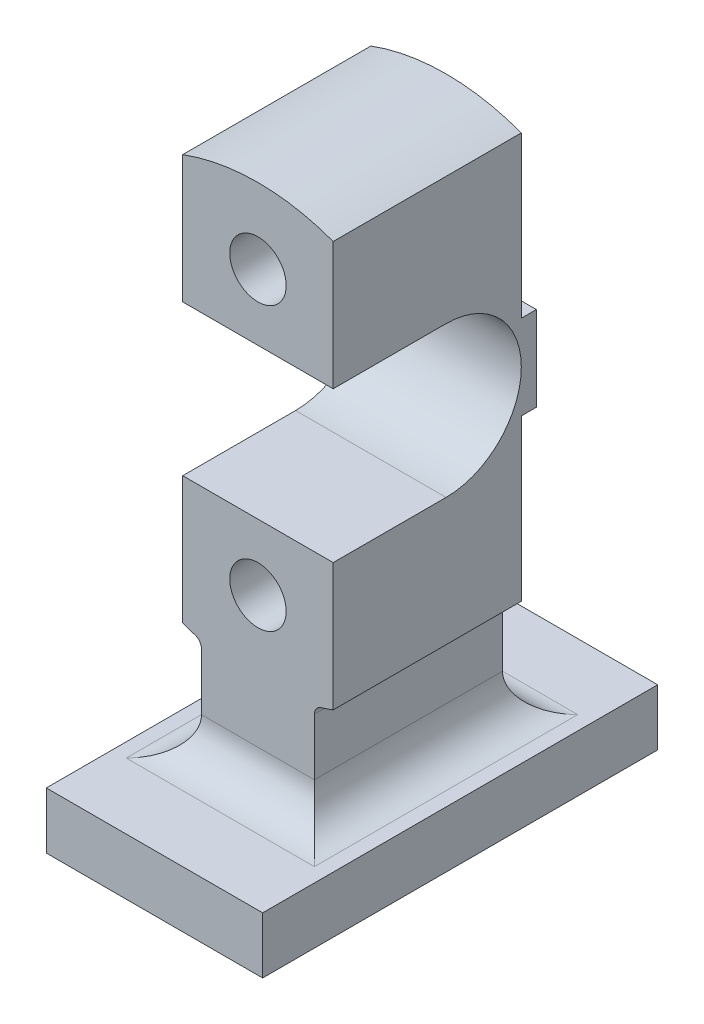
ISO-10303-21;
HEADER;
FILE_DESCRIPTION(('STEP AP214'),'2;1');
FILE_NAME('part.step','',(''),(''),'','','');
FILE_SCHEMA(('AUTOMOTIVE_DESIGN { 1 0 10303 214 1 1 1 1 }'));
ENDSEC;
DATA;
#1=APPLICATION_CONTEXT('core data for automotive mechanical design processes');
#2=APPLICATION_PROTOCOL_DEFINITION('international standard','automotive_design',2000,#1);
#3=PRODUCT_CONTEXT('',#1,'mechanical');
#4=PRODUCT('Part','Part','',(#3));
#5=PRODUCT_RELATED_PRODUCT_CATEGORY('part','',(#4));
#6=PRODUCT_DEFINITION_FORMATION('','',#4);
#7=PRODUCT_DEFINITION_CONTEXT('part definition',#1,'design');
#8=PRODUCT_DEFINITION('design','',#6,#7);
#9=PRODUCT_DEFINITION_SHAPE('','',#8);
#10=(LENGTH_UNIT() NAMED_UNIT(*) SI_UNIT(.MILLI.,.METRE.));
#11=(NAMED_UNIT(*) PLANE_ANGLE_UNIT() SI_UNIT($,.RADIAN.));
#12=(NAMED_UNIT(*) SI_UNIT($,.STERADIAN.) SOLID_ANGLE_UNIT());
#13=UNCERTAINTY_MEASURE_WITH_UNIT(LENGTH_MEASURE(1.E-05),#10,'distance_accuracy_value','');
#14=(GEOMETRIC_REPRESENTATION_CONTEXT(3) GLOBAL_UNCERTAINTY_ASSIGNED_CONTEXT((#13)) GLOBAL_UNIT_ASSIGNED_CONTEXT((#10,
#11,#12)) REPRESENTATION_CONTEXT('',''));
#15=CARTESIAN_POINT('',(0.,0.,0.));
#16=DIRECTION('',(0.,0.,1.));
#17=DIRECTION('',(1.,0.,0.));
#18=AXIS2_PLACEMENT_3D('',#15,#16,#17);
#19=CARTESIAN_POINT('',(0.,0.,100.));
#20=DIRECTION('',(0.,0.,1.));
#21=DIRECTION('',(1.,0.,0.));
#22=AXIS2_PLACEMENT_3D('',#19,#20,#21);
#23=PLANE('',#22);
#24=DIRECTION('',(1.,0.,0.));
#25=VECTOR('',#24,1.);
#26=CARTESIAN_POINT('',(-40.,-40.,100.));
#27=LINE('',#26,#25);
#28=CARTESIAN_POINT('',(-40.,-40.,100.));
#29=VERTEX_POINT('',#28);
#30=CARTESIAN_POINT('',(40.,-40.,100.));
#31=VERTEX_POINT('',#30);
#32=EDGE_CURVE('E248',#29,#31,#27,.T.);
#33=ORIENTED_EDGE('',*,*,#32,.F.);
#34=DIRECTION('',(0.,1.,0.));
#35=VECTOR('',#34,1.);
#36=CARTESIAN_POINT('',(-40.,0.,100.));
#37=LINE('',#36,#35);
#38=CARTESIAN_POINT('',(-40.,-107.819293264239,100.));
#39=VERTEX_POINT('',#38);
#40=EDGE_CURVE('E359',#39,#29,#37,.T.);
#41=ORIENTED_EDGE('',*,*,#40,.F.);
#42=CARTESIAN_POINT('',(0.,0.,100.));
#43=DIRECTION('',(0.,0.,1.));
#44=DIRECTION('',(1.,0.,0.));
#45=AXIS2_PLACEMENT_3D('',#42,#43,#44);
#46=CIRCLE('',#45,115.);
#47=CARTESIAN_POINT('',(-33.5416666666667,-109.99980271447,100.));
#48=VERTEX_POINT('',#47);
#49=EDGE_CURVE('E362',#39,#48,#46,.T.);
#50=ORIENTED_EDGE('',*,*,#49,.T.);
#51=CARTESIAN_POINT('',(-35.,-114.78240283249,100.));
#52=DIRECTION('',(0.,0.,1.));
#53=DIRECTION('',(1.,0.,0.));
#54=AXIS2_PLACEMENT_3D('',#51,#52,#53);
#55=CIRCLE('',#54,5.);
#56=CARTESIAN_POINT('',(-30.,-114.78240283249,100.));
#57=VERTEX_POINT('',#56);
#58=EDGE_CURVE('E365',#48,#57,#55,.F.);
#59=ORIENTED_EDGE('',*,*,#58,.T.);
#60=DIRECTION('',(0.,-1.,0.));
#61=VECTOR('',#60,1.);
#62=CARTESIAN_POINT('',(-30.,0.,100.));
#63=LINE('',#62,#61);
#64=CARTESIAN_POINT('',(-30.,-145.,100.));
#65=VERTEX_POINT('',#64);
#66=EDGE_CURVE('E368',#57,#65,#63,.T.);
#67=ORIENTED_EDGE('',*,*,#66,.T.);
#68=DIRECTION('',(1.,0.,0.));
#69=VECTOR('',#68,1.);
#70=CARTESIAN_POINT('',(0.,-145.,100.));
#71=LINE('',#70,#69);
#72=CARTESIAN_POINT('',(30.,-145.,100.));
#73=VERTEX_POINT('',#72);
#74=EDGE_CURVE('E456',#65,#73,#71,.T.);
#75=ORIENTED_EDGE('',*,*,#74,.T.);
#76=DIRECTION('',(0.,-1.,0.));
#77=VECTOR('',#76,1.);
#78=CARTESIAN_POINT('',(30.,0.,100.));
#79=LINE('',#78,#77);
#80=CARTESIAN_POINT('',(30.,-114.78240283249,100.));
#81=VERTEX_POINT('',#80);
#82=EDGE_CURVE('E338',#81,#73,#79,.T.);
#83=ORIENTED_EDGE('',*,*,#82,.F.);
#84=CARTESIAN_POINT('',(35.,-114.78240283249,100.));
#85=DIRECTION('',(0.,0.,1.));
#86=DIRECTION('',(1.,0.,0.));
#87=AXIS2_PLACEMENT_3D('',#84,#85,#86);
#88=CIRCLE('',#87,5.);
#89=CARTESIAN_POINT('',(33.5416666666666,-109.99980271447,100.));
#90=VERTEX_POINT('',#89);
#91=EDGE_CURVE('E342',#90,#81,#88,.T.);
#92=ORIENTED_EDGE('',*,*,#91,.F.);
#93=CARTESIAN_POINT('',(0.,0.,100.));
#94=DIRECTION('',(0.,0.,1.));
#95=DIRECTION('',(1.,0.,0.));
#96=AXIS2_PLACEMENT_3D('',#93,#94,#95);
#97=CIRCLE('',#96,115.);
#98=CARTESIAN_POINT('',(40.,-107.819293264239,100.));
#99=VERTEX_POINT('',#98);
#100=EDGE_CURVE('E346',#90,#99,#97,.T.);
#101=ORIENTED_EDGE('',*,*,#100,.T.);
#102=DIRECTION('',(0.,1.,0.));
#103=VECTOR('',#102,1.);
#104=CARTESIAN_POINT('',(40.,0.,100.));
#105=LINE('',#104,#103);
#106=EDGE_CURVE('E350',#99,#31,#105,.T.);
#107=ORIENTED_EDGE('',*,*,#106,.T.);
#108=EDGE_LOOP('',(#33,#41,#50,#59,#67,#75,#83,#92,#101,#107));
#109=FACE_BOUND('',#108,.T.);
#110=CARTESIAN_POINT('',(0.,-75.,100.));
#111=DIRECTION('',(0.,0.,1.));
#112=DIRECTION('',(1.,0.,0.));
#113=AXIS2_PLACEMENT_3D('',#110,#111,#112);
#114=CIRCLE('',#113,15.);
#115=CARTESIAN_POINT('',(15.,-75.,100.));
#116=VERTEX_POINT('',#115);
#117=EDGE_CURVE('E329',#116,#116,#114,.F.);
#118=ORIENTED_EDGE('',*,*,#117,.T.);
#119=EDGE_LOOP('',(#118));
#120=FACE_BOUND('',#119,.T.);
#121=ADVANCED_FACE('F45',(#109,#120),#23,.T.);
#122=CARTESIAN_POINT('',(0.,0.,0.));
#123=DIRECTION('',(0.,0.,1.));
#124=DIRECTION('',(1.,0.,0.));
#125=AXIS2_PLACEMENT_3D('',#122,#123,#124);
#126=PLANE('',#125);
#127=CARTESIAN_POINT('',(0.,75.,0.));
#128=DIRECTION('',(0.,0.,1.));
#129=DIRECTION('',(1.,0.,0.));
#130=AXIS2_PLACEMENT_3D('',#127,#128,#129);
#131=CIRCLE('',#130,15.);
#132=CARTESIAN_POINT('',(15.,75.,0.));
#133=VERTEX_POINT('',#132);
#134=EDGE_CURVE('E376',#133,#133,#131,.T.);
#135=ORIENTED_EDGE('',*,*,#134,.T.);
#136=EDGE_LOOP('',(#135));
#137=FACE_BOUND('',#136,.T.);
#138=DIRECTION('',(0.,1.,0.));
#139=VECTOR('',#138,1.);
#140=CARTESIAN_POINT('',(40.,0.,0.));
#141=LINE('',#140,#139);
#142=CARTESIAN_POINT('',(40.,22.5,0.));
#143=VERTEX_POINT('',#142);
#144=CARTESIAN_POINT('',(40.,107.819293264239,0.));
#145=VERTEX_POINT('',#144);
#146=EDGE_CURVE('E391',#143,#145,#141,.T.);
#147=ORIENTED_EDGE('',*,*,#146,.F.);
#148=DIRECTION('',(1.,0.,0.));
#149=VECTOR('',#148,1.);
#150=CARTESIAN_POINT('',(-40.,22.5,0.));
#151=LINE('',#150,#149);
#152=CARTESIAN_POINT('',(-40.,22.5,0.));
#153=VERTEX_POINT('',#152);
#154=EDGE_CURVE('E273',#153,#143,#151,.T.);
#155=ORIENTED_EDGE('',*,*,#154,.F.);
#156=DIRECTION('',(0.,1.,0.));
#157=VECTOR('',#156,1.);
#158=CARTESIAN_POINT('',(-40.,0.,0.));
#159=LINE('',#158,#157);
#160=CARTESIAN_POINT('',(-40.,107.819293264239,0.));
#161=VERTEX_POINT('',#160);
#162=EDGE_CURVE('E400',#153,#161,#159,.T.);
#163=ORIENTED_EDGE('',*,*,#162,.T.);
#164=CARTESIAN_POINT('',(0.,0.,0.));
#165=DIRECTION('',(0.,0.,1.));
#166=DIRECTION('',(1.,0.,0.));
#167=AXIS2_PLACEMENT_3D('',#164,#165,#166);
#168=CIRCLE('',#167,115.);
#169=EDGE_CURVE('E396',#145,#161,#168,.T.);
#170=ORIENTED_EDGE('',*,*,#169,.F.);
#171=EDGE_LOOP('',(#147,#155,#163,#170));
#172=FACE_BOUND('',#171,.T.);
#173=ADVANCED_FACE('F567',(#137,#172),#126,.F.);
#174=CARTESIAN_POINT('',(-57.5,-195.,160.));
#175=DIRECTION('',(1.,0.,0.));
#176=DIRECTION('',(0.,1.,0.));
#177=AXIS2_PLACEMENT_3D('',#174,#175,#176);
#178=PLANE('',#177);
#179=DIRECTION('',(0.,0.,-1.));
#180=VECTOR('',#179,1.);
#181=CARTESIAN_POINT('',(-57.5,-195.,160.));
#182=LINE('',#181,#180);
#183=CARTESIAN_POINT('',(-57.5,-195.,155.));
#184=VERTEX_POINT('',#183);
#185=CARTESIAN_POINT('',(-57.5,-195.,-55.));
#186=VERTEX_POINT('',#185);
#187=EDGE_CURVE('E324',#184,#186,#182,.T.);
#188=ORIENTED_EDGE('',*,*,#187,.F.);
#189=DIRECTION('',(0.,1.,0.));
#190=VECTOR('',#189,1.);
#191=CARTESIAN_POINT('',(-57.5,-195.,155.));
#192=LINE('',#191,#190);
#193=CARTESIAN_POINT('',(-57.5,-165.,155.));
#194=VERTEX_POINT('',#193);
#195=EDGE_CURVE('E308',#184,#194,#192,.T.);
#196=ORIENTED_EDGE('',*,*,#195,.T.);
#197=DIRECTION('',(0.,0.,-1.));
#198=VECTOR('',#197,1.);
#199=CARTESIAN_POINT('',(-57.5,-165.,160.));
#200=LINE('',#199,#198);
#201=CARTESIAN_POINT('',(-57.5,-165.,-55.));
#202=VERTEX_POINT('',#201);
#203=EDGE_CURVE('E312',#194,#202,#200,.T.);
#204=ORIENTED_EDGE('',*,*,#203,.T.);
#205=DIRECTION('',(0.,1.,0.));
#206=VECTOR('',#205,1.);
#207=CARTESIAN_POINT('',(-57.5,-195.,-55.));
#208=LINE('',#207,#206);
#209=EDGE_CURVE('E294',#186,#202,#208,.T.);
#210=ORIENTED_EDGE('',*,*,#209,.F.);
#211=EDGE_LOOP('',(#188,#196,#204,#210));
#212=FACE_BOUND('',#211,.T.);
#213=ADVANCED_FACE('F547',(#212),#178,.F.);
#214=CARTESIAN_POINT('',(57.5,-195.,160.));
#215=DIRECTION('',(0.,1.,0.));
#216=DIRECTION('',(-1.,0.,0.));
#217=AXIS2_PLACEMENT_3D('',#214,#215,#216);
#218=PLANE('',#217);
#219=DIRECTION('',(0.,0.,-1.));
#220=VECTOR('',#219,1.);
#221=CARTESIAN_POINT('',(57.5,-195.,160.));
#222=LINE('',#221,#220);
#223=CARTESIAN_POINT('',(57.5,-195.,155.));
#224=VERTEX_POINT('',#223);
#225=CARTESIAN_POINT('',(57.5,-195.,-55.));
#226=VERTEX_POINT('',#225);
#227=EDGE_CURVE('E320',#224,#226,#222,.T.);
#228=ORIENTED_EDGE('',*,*,#227,.F.);
#229=DIRECTION('',(1.,0.,0.));
#230=VECTOR('',#229,1.);
#231=CARTESIAN_POINT('',(-262.5,-195.,155.));
#232=LINE('',#231,#230);
#233=EDGE_CURVE('E288',#184,#224,#232,.T.);
#234=ORIENTED_EDGE('',*,*,#233,.F.);
#235=ORIENTED_EDGE('',*,*,#187,.T.);
#236=DIRECTION('',(1.,0.,0.));
#237=VECTOR('',#236,1.);
#238=CARTESIAN_POINT('',(-262.5,-195.,-55.));
#239=LINE('',#238,#237);
#240=EDGE_CURVE('E276',#186,#226,#239,.T.);
#241=ORIENTED_EDGE('',*,*,#240,.T.);
#242=EDGE_LOOP('',(#228,#234,#235,#241));
#243=FACE_BOUND('',#242,.T.);
#244=ADVANCED_FACE('F554',(#243),#218,.F.);
#245=CARTESIAN_POINT('',(57.5,-195.,160.));
#246=DIRECTION('',(-1.,0.,0.));
#247=DIRECTION('',(0.,-1.,0.));
#248=AXIS2_PLACEMENT_3D('',#245,#246,#247);
#249=PLANE('',#248);
#250=DIRECTION('',(0.,0.,-1.));
#251=VECTOR('',#250,1.);
#252=CARTESIAN_POINT('',(57.5,-165.,160.));
#253=LINE('',#252,#251);
#254=CARTESIAN_POINT('',(57.5,-165.,155.));
#255=VERTEX_POINT('',#254);
#256=CARTESIAN_POINT('',(57.5,-165.,-55.));
#257=VERTEX_POINT('',#256);
#258=EDGE_CURVE('E316',#255,#257,#253,.T.);
#259=ORIENTED_EDGE('',*,*,#258,.F.);
#260=DIRECTION('',(0.,1.,0.));
#261=VECTOR('',#260,1.);
#262=CARTESIAN_POINT('',(57.5,0.,155.));
#263=LINE('',#262,#261);
#264=EDGE_CURVE('E286',#224,#255,#263,.T.);
#265=ORIENTED_EDGE('',*,*,#264,.F.);
#266=ORIENTED_EDGE('',*,*,#227,.T.);
#267=DIRECTION('',(0.,1.,0.));
#268=VECTOR('',#267,1.);
#269=CARTESIAN_POINT('',(57.5,-195.,-55.));
#270=LINE('',#269,#268);
#271=EDGE_CURVE('E289',#226,#257,#270,.T.);
#272=ORIENTED_EDGE('',*,*,#271,.T.);
#273=EDGE_LOOP('',(#259,#265,#266,#272));
#274=FACE_BOUND('',#273,.T.);
#275=ADVANCED_FACE('F539',(#274),#249,.F.);
#276=CARTESIAN_POINT('',(57.5,-165.,160.));
#277=DIRECTION('',(0.,-1.,0.));
#278=DIRECTION('',(1.,0.,0.));
#279=AXIS2_PLACEMENT_3D('',#276,#277,#278);
#280=PLANE('',#279);
#281=DIRECTION('',(1.,0.,0.));
#282=VECTOR('',#281,1.);
#283=CARTESIAN_POINT('',(50.,-165.,-20.));
#284=LINE('',#283,#282);
#285=CARTESIAN_POINT('',(-50.,-165.,-20.));
#286=VERTEX_POINT('',#285);
#287=CARTESIAN_POINT('',(50.,-165.,-20.));
#288=VERTEX_POINT('',#287);
#289=EDGE_CURVE('E471',#286,#288,#284,.T.);
#290=ORIENTED_EDGE('',*,*,#289,.T.);
#291=DIRECTION('',(0.,0.,-1.));
#292=VECTOR('',#291,1.);
#293=CARTESIAN_POINT('',(50.,-165.,100.));
#294=LINE('',#293,#292);
#295=CARTESIAN_POINT('',(50.,-165.,120.));
#296=VERTEX_POINT('',#295);
#297=EDGE_CURVE('E453',#296,#288,#294,.T.);
#298=ORIENTED_EDGE('',*,*,#297,.F.);
#299=DIRECTION('',(1.,0.,0.));
#300=VECTOR('',#299,1.);
#301=CARTESIAN_POINT('',(57.5,-165.,120.));
#302=LINE('',#301,#300);
#303=CARTESIAN_POINT('',(-50.,-165.,120.));
#304=VERTEX_POINT('',#303);
#305=EDGE_CURVE('E460',#296,#304,#302,.F.);
#306=ORIENTED_EDGE('',*,*,#305,.T.);
#307=DIRECTION('',(0.,0.,-1.));
#308=VECTOR('',#307,1.);
#309=CARTESIAN_POINT('',(-50.,-165.,100.));
#310=LINE('',#309,#308);
#311=EDGE_CURVE('E372',#304,#286,#310,.T.);
#312=ORIENTED_EDGE('',*,*,#311,.T.);
#313=EDGE_LOOP('',(#290,#298,#306,#312));
#314=FACE_BOUND('',#313,.T.);
#315=ORIENTED_EDGE('',*,*,#203,.F.);
#316=DIRECTION('',(1.,0.,0.));
#317=VECTOR('',#316,1.);
#318=CARTESIAN_POINT('',(-262.5,-165.,155.));
#319=LINE('',#318,#317);
#320=EDGE_CURVE('E290',#194,#255,#319,.T.);
#321=ORIENTED_EDGE('',*,*,#320,.T.);
#322=ORIENTED_EDGE('',*,*,#258,.T.);
#323=DIRECTION('',(1.,0.,0.));
#324=VECTOR('',#323,1.);
#325=CARTESIAN_POINT('',(-262.5,-165.,-55.));
#326=LINE('',#325,#324);
#327=EDGE_CURVE('E300',#202,#257,#326,.T.);
#328=ORIENTED_EDGE('',*,*,#327,.F.);
#329=EDGE_LOOP('',(#315,#321,#322,#328));
#330=FACE_BOUND('',#329,.T.);
#331=ADVANCED_FACE('F536',(#314,#330),#280,.F.);
#332=CARTESIAN_POINT('',(50.,-145.,100.));
#333=DIRECTION('',(0.,0.,-1.));
#334=DIRECTION('',(-1.,0.,0.));
#335=AXIS2_PLACEMENT_3D('',#332,#333,#334);
#336=CYLINDRICAL_SURFACE('',#335,20.);
#337=ORIENTED_EDGE('',*,*,#297,.T.);
#338=CARTESIAN_POINT('',(50.,-145.,-20.));
#339=DIRECTION('',(-0.707106781186548,0.,-0.707106781186547));
#340=DIRECTION('',(0.707106781186548,0.,-0.707106781186547));
#341=AXIS2_PLACEMENT_3D('',#338,#339,#340);
#342=ELLIPSE('',#341,28.2842712474619,20.);
#343=CARTESIAN_POINT('',(30.,-145.,0.));
#344=VERTEX_POINT('',#343);
#345=EDGE_CURVE('E54',#288,#344,#342,.T.);
#346=ORIENTED_EDGE('',*,*,#345,.T.);
#347=DIRECTION('',(0.,0.,-1.));
#348=VECTOR('',#347,1.);
#349=CARTESIAN_POINT('',(30.,-145.,100.));
#350=LINE('',#349,#348);
#351=EDGE_CURVE('E449',#73,#344,#350,.T.);
#352=ORIENTED_EDGE('',*,*,#351,.F.);
#353=CARTESIAN_POINT('',(50.,-145.,120.));
#354=DIRECTION('',(0.707106781186548,0.,-0.707106781186547));
#355=DIRECTION('',(-0.707106781186548,0.,-0.707106781186547));
#356=AXIS2_PLACEMENT_3D('',#353,#354,#355);
#357=ELLIPSE('',#356,28.2842712474619,20.);
#358=EDGE_CURVE('E464',#73,#296,#357,.F.);
#359=ORIENTED_EDGE('',*,*,#358,.T.);
#360=EDGE_LOOP('',(#337,#346,#352,#359));
#361=FACE_BOUND('',#360,.T.);
#362=ADVANCED_FACE('F481',(#361),#336,.F.);
#363=CARTESIAN_POINT('',(30.,0.,100.));
#364=DIRECTION('',(1.,0.,0.));
#365=DIRECTION('',(0.,1.,0.));
#366=AXIS2_PLACEMENT_3D('',#363,#364,#365);
#367=PLANE('',#366);
#368=DIRECTION('',(0.,-1.,0.));
#369=VECTOR('',#368,1.);
#370=CARTESIAN_POINT('',(30.,0.,0.));
#371=LINE('',#370,#369);
#372=CARTESIAN_POINT('',(30.,-114.78240283249,0.));
#373=VERTEX_POINT('',#372);
#374=EDGE_CURVE('E380',#373,#344,#371,.T.);
#375=ORIENTED_EDGE('',*,*,#374,.F.);
#376=DIRECTION('',(0.,0.,-1.));
#377=VECTOR('',#376,1.);
#378=CARTESIAN_POINT('',(30.,-114.78240283249,100.));
#379=LINE('',#378,#377);
#380=EDGE_CURVE('E446',#81,#373,#379,.T.);
#381=ORIENTED_EDGE('',*,*,#380,.F.);
#382=ORIENTED_EDGE('',*,*,#82,.T.);
#383=ORIENTED_EDGE('',*,*,#351,.T.);
#384=EDGE_LOOP('',(#375,#381,#382,#383));
#385=FACE_BOUND('',#384,.T.);
#386=ADVANCED_FACE('F487',(#385),#367,.T.);
#387=CARTESIAN_POINT('',(35.,-114.78240283249,100.));
#388=DIRECTION('',(0.,0.,-1.));
#389=DIRECTION('',(-1.,0.,0.));
#390=AXIS2_PLACEMENT_3D('',#387,#388,#389);
#391=CYLINDRICAL_SURFACE('',#390,5.);
#392=CARTESIAN_POINT('',(35.,-114.78240283249,0.));
#393=DIRECTION('',(0.,0.,1.));
#394=DIRECTION('',(1.,0.,0.));
#395=AXIS2_PLACEMENT_3D('',#392,#393,#394);
#396=CIRCLE('',#395,5.);
#397=CARTESIAN_POINT('',(33.5416666666666,-109.99980271447,0.));
#398=VERTEX_POINT('',#397);
#399=EDGE_CURVE('E384',#398,#373,#396,.T.);
#400=ORIENTED_EDGE('',*,*,#399,.F.);
#401=DIRECTION('',(0.,0.,-1.));
#402=VECTOR('',#401,1.);
#403=CARTESIAN_POINT('',(33.5416666666666,-109.99980271447,100.));
#404=LINE('',#403,#402);
#405=EDGE_CURVE('E443',#90,#398,#404,.T.);
#406=ORIENTED_EDGE('',*,*,#405,.F.);
#407=ORIENTED_EDGE('',*,*,#91,.T.);
#408=ORIENTED_EDGE('',*,*,#380,.T.);
#409=EDGE_LOOP('',(#400,#406,#407,#408));
#410=FACE_BOUND('',#409,.T.);
#411=ADVANCED_FACE('F528',(#410),#391,.F.);
#412=CARTESIAN_POINT('',(0.,0.,100.));
#413=DIRECTION('',(0.,0.,-1.));
#414=DIRECTION('',(-1.,0.,0.));
#415=AXIS2_PLACEMENT_3D('',#412,#413,#414);
#416=CYLINDRICAL_SURFACE('',#415,115.);
#417=CARTESIAN_POINT('',(0.,0.,0.));
#418=DIRECTION('',(0.,0.,1.));
#419=DIRECTION('',(1.,0.,0.));
#420=AXIS2_PLACEMENT_3D('',#417,#418,#419);
#421=CIRCLE('',#420,115.);
#422=CARTESIAN_POINT('',(40.,-107.819293264239,0.));
#423=VERTEX_POINT('',#422);
#424=EDGE_CURVE('E388',#398,#423,#421,.T.);
#425=ORIENTED_EDGE('',*,*,#424,.T.);
#426=DIRECTION('',(0.,0.,-1.));
#427=VECTOR('',#426,1.);
#428=CARTESIAN_POINT('',(40.,-107.819293264239,100.));
#429=LINE('',#428,#427);
#430=EDGE_CURVE('E439',#99,#423,#429,.T.);
#431=ORIENTED_EDGE('',*,*,#430,.F.);
#432=ORIENTED_EDGE('',*,*,#100,.F.);
#433=ORIENTED_EDGE('',*,*,#405,.T.);
#434=EDGE_LOOP('',(#425,#431,#432,#433));
#435=FACE_BOUND('',#434,.T.);
#436=ADVANCED_FACE('F525',(#435),#416,.T.);
#437=CARTESIAN_POINT('',(40.,0.,100.));
#438=DIRECTION('',(-1.,0.,0.));
#439=DIRECTION('',(0.,0.,1.));
#440=AXIS2_PLACEMENT_3D('',#437,#438,#439);
#441=PLANE('',#440);
#442=CARTESIAN_POINT('',(40.,0.,40.));
#443=DIRECTION('',(1.,0.,0.));
#444=DIRECTION('',(0.,0.,-1.));
#445=AXIS2_PLACEMENT_3D('',#442,#443,#444);
#446=CIRCLE('',#445,40.);
#447=CARTESIAN_POINT('',(40.,-40.,40.));
#448=VERTEX_POINT('',#447);
#449=CARTESIAN_POINT('',(40.,40.,40.));
#450=VERTEX_POINT('',#449);
#451=EDGE_CURVE('E215',#448,#450,#446,.T.);
#452=ORIENTED_EDGE('',*,*,#451,.F.);
#453=DIRECTION('',(0.,0.,-1.));
#454=VECTOR('',#453,1.);
#455=CARTESIAN_POINT('',(40.,-40.,100.));
#456=LINE('',#455,#454);
#457=EDGE_CURVE('E230',#31,#448,#456,.T.);
#458=ORIENTED_EDGE('',*,*,#457,.F.);
#459=ORIENTED_EDGE('',*,*,#106,.F.);
#460=ORIENTED_EDGE('',*,*,#430,.T.);
#461=CARTESIAN_POINT('',(40.,-22.5,0.));
#462=VERTEX_POINT('',#461);
#463=EDGE_CURVE('E392',#423,#462,#141,.T.);
#464=ORIENTED_EDGE('',*,*,#463,.T.);
#465=DIRECTION('',(0.,0.,-1.));
#466=VECTOR('',#465,1.);
#467=CARTESIAN_POINT('',(40.,-22.5,0.));
#468=LINE('',#467,#466);
#469=CARTESIAN_POINT('',(40.,-22.5,-8.));
#470=VERTEX_POINT('',#469);
#471=EDGE_CURVE('E247',#462,#470,#468,.T.);
#472=ORIENTED_EDGE('',*,*,#471,.T.);
#473=DIRECTION('',(0.,1.,0.));
#474=VECTOR('',#473,1.);
#475=CARTESIAN_POINT('',(40.,-22.5,-8.));
#476=LINE('',#475,#474);
#477=CARTESIAN_POINT('',(40.,22.5,-8.));
#478=VERTEX_POINT('',#477);
#479=EDGE_CURVE('E268',#470,#478,#476,.T.);
#480=ORIENTED_EDGE('',*,*,#479,.T.);
#481=DIRECTION('',(0.,0.,1.));
#482=VECTOR('',#481,1.);
#483=CARTESIAN_POINT('',(40.,22.5,0.));
#484=LINE('',#483,#482);
#485=EDGE_CURVE('E69',#478,#143,#484,.T.);
#486=ORIENTED_EDGE('',*,*,#485,.T.);
#487=ORIENTED_EDGE('',*,*,#146,.T.);
#488=DIRECTION('',(0.,0.,-1.));
#489=VECTOR('',#488,1.);
#490=CARTESIAN_POINT('',(40.,107.819293264239,100.));
#491=LINE('',#490,#489);
#492=CARTESIAN_POINT('',(40.,107.819293264239,100.));
#493=VERTEX_POINT('',#492);
#494=EDGE_CURVE('E435',#493,#145,#491,.T.);
#495=ORIENTED_EDGE('',*,*,#494,.F.);
#496=CARTESIAN_POINT('',(40.,40.,100.));
#497=VERTEX_POINT('',#496);
#498=EDGE_CURVE('E349',#497,#493,#105,.T.);
#499=ORIENTED_EDGE('',*,*,#498,.F.);
#500=DIRECTION('',(0.,0.,1.));
#501=VECTOR('',#500,1.);
#502=CARTESIAN_POINT('',(40.,40.,40.));
#503=LINE('',#502,#501);
#504=EDGE_CURVE('E61',#450,#497,#503,.T.);
#505=ORIENTED_EDGE('',*,*,#504,.F.);
#506=EDGE_LOOP('',(#452,#458,#459,#460,#464,#472,#480,#486,#487,#495,#499,#505));
#507=FACE_BOUND('',#506,.T.);
#508=ADVANCED_FACE('F519',(#507),#441,.F.);
#509=CARTESIAN_POINT('',(0.,0.,100.));
#510=DIRECTION('',(0.,0.,-1.));
#511=DIRECTION('',(-1.,0.,0.));
#512=AXIS2_PLACEMENT_3D('',#509,#510,#511);
#513=CYLINDRICAL_SURFACE('',#512,115.);
#514=ORIENTED_EDGE('',*,*,#169,.T.);
#515=DIRECTION('',(0.,0.,-1.));
#516=VECTOR('',#515,1.);
#517=CARTESIAN_POINT('',(-40.,107.819293264239,100.));
#518=LINE('',#517,#516);
#519=CARTESIAN_POINT('',(-40.,107.819293264239,100.));
#520=VERTEX_POINT('',#519);
#521=EDGE_CURVE('E431',#520,#161,#518,.T.);
#522=ORIENTED_EDGE('',*,*,#521,.F.);
#523=CARTESIAN_POINT('',(0.,0.,100.));
#524=DIRECTION('',(0.,0.,1.));
#525=DIRECTION('',(1.,0.,0.));
#526=AXIS2_PLACEMENT_3D('',#523,#524,#525);
#527=CIRCLE('',#526,115.);
#528=EDGE_CURVE('E354',#493,#520,#527,.T.);
#529=ORIENTED_EDGE('',*,*,#528,.F.);
#530=ORIENTED_EDGE('',*,*,#494,.T.);
#531=EDGE_LOOP('',(#514,#522,#529,#530));
#532=FACE_BOUND('',#531,.T.);
#533=ADVANCED_FACE('F598',(#532),#513,.T.);
#534=CARTESIAN_POINT('',(-40.,0.,100.));
#535=DIRECTION('',(-1.,0.,0.));
#536=DIRECTION('',(0.,0.,1.));
#537=AXIS2_PLACEMENT_3D('',#534,#535,#536);
#538=PLANE('',#537);
#539=DIRECTION('',(0.,0.,-1.));
#540=VECTOR('',#539,1.);
#541=CARTESIAN_POINT('',(-40.,-40.,100.));
#542=LINE('',#541,#540);
#543=CARTESIAN_POINT('',(-40.,-40.,40.));
#544=VERTEX_POINT('',#543);
#545=EDGE_CURVE('E218',#29,#544,#542,.T.);
#546=ORIENTED_EDGE('',*,*,#545,.T.);
#547=CARTESIAN_POINT('',(-40.,0.,40.));
#548=DIRECTION('',(1.,0.,0.));
#549=DIRECTION('',(0.,0.,-1.));
#550=AXIS2_PLACEMENT_3D('',#547,#548,#549);
#551=CIRCLE('',#550,40.);
#552=CARTESIAN_POINT('',(-40.,40.,40.));
#553=VERTEX_POINT('',#552);
#554=EDGE_CURVE('E212',#544,#553,#551,.T.);
#555=ORIENTED_EDGE('',*,*,#554,.T.);
#556=DIRECTION('',(0.,0.,1.));
#557=VECTOR('',#556,1.);
#558=CARTESIAN_POINT('',(-40.,40.,40.));
#559=LINE('',#558,#557);
#560=CARTESIAN_POINT('',(-40.,40.,100.));
#561=VERTEX_POINT('',#560);
#562=EDGE_CURVE('E221',#553,#561,#559,.T.);
#563=ORIENTED_EDGE('',*,*,#562,.T.);
#564=EDGE_CURVE('E358',#561,#520,#37,.T.);
#565=ORIENTED_EDGE('',*,*,#564,.T.);
#566=ORIENTED_EDGE('',*,*,#521,.T.);
#567=ORIENTED_EDGE('',*,*,#162,.F.);
#568=DIRECTION('',(0.,0.,1.));
#569=VECTOR('',#568,1.);
#570=CARTESIAN_POINT('',(-40.,22.5,0.));
#571=LINE('',#570,#569);
#572=CARTESIAN_POINT('',(-40.,22.5,-8.));
#573=VERTEX_POINT('',#572);
#574=EDGE_CURVE('E261',#573,#153,#571,.T.);
#575=ORIENTED_EDGE('',*,*,#574,.F.);
#576=DIRECTION('',(0.,1.,0.));
#577=VECTOR('',#576,1.);
#578=CARTESIAN_POINT('',(-40.,-22.5,-8.));
#579=LINE('',#578,#577);
#580=CARTESIAN_POINT('',(-40.,-22.5,-8.));
#581=VERTEX_POINT('',#580);
#582=EDGE_CURVE('E257',#581,#573,#579,.T.);
#583=ORIENTED_EDGE('',*,*,#582,.F.);
#584=DIRECTION('',(0.,0.,-1.));
#585=VECTOR('',#584,1.);
#586=CARTESIAN_POINT('',(-40.,-22.5,0.));
#587=LINE('',#586,#585);
#588=CARTESIAN_POINT('',(-40.,-22.5,0.));
#589=VERTEX_POINT('',#588);
#590=EDGE_CURVE('E253',#589,#581,#587,.T.);
#591=ORIENTED_EDGE('',*,*,#590,.F.);
#592=CARTESIAN_POINT('',(-40.,-107.819293264239,0.));
#593=VERTEX_POINT('',#592);
#594=EDGE_CURVE('E401',#593,#589,#159,.T.);
#595=ORIENTED_EDGE('',*,*,#594,.F.);
#596=DIRECTION('',(0.,0.,-1.));
#597=VECTOR('',#596,1.);
#598=CARTESIAN_POINT('',(-40.,-107.819293264239,100.));
#599=LINE('',#598,#597);
#600=EDGE_CURVE('E428',#39,#593,#599,.T.);
#601=ORIENTED_EDGE('',*,*,#600,.F.);
#602=ORIENTED_EDGE('',*,*,#40,.T.);
#603=EDGE_LOOP('',(#546,#555,#563,#565,#566,#567,#575,#583,#591,#595,#601,#602));
#604=FACE_BOUND('',#603,.T.);
#605=ADVANCED_FACE('F227',(#604),#538,.T.);
#606=CARTESIAN_POINT('',(0.,0.,100.));
#607=DIRECTION('',(0.,0.,-1.));
#608=DIRECTION('',(-1.,0.,0.));
#609=AXIS2_PLACEMENT_3D('',#606,#607,#608);
#610=CYLINDRICAL_SURFACE('',#609,115.);
#611=CARTESIAN_POINT('',(0.,0.,0.));
#612=DIRECTION('',(0.,0.,1.));
#613=DIRECTION('',(1.,0.,0.));
#614=AXIS2_PLACEMENT_3D('',#611,#612,#613);
#615=CIRCLE('',#614,115.);
#616=CARTESIAN_POINT('',(-33.5416666666667,-109.99980271447,0.));
#617=VERTEX_POINT('',#616);
#618=EDGE_CURVE('E405',#593,#617,#615,.T.);
#619=ORIENTED_EDGE('',*,*,#618,.T.);
#620=DIRECTION('',(0.,0.,-1.));
#621=VECTOR('',#620,1.);
#622=CARTESIAN_POINT('',(-33.5416666666667,-109.99980271447,100.));
#623=LINE('',#622,#621);
#624=EDGE_CURVE('E424',#48,#617,#623,.T.);
#625=ORIENTED_EDGE('',*,*,#624,.F.);
#626=ORIENTED_EDGE('',*,*,#49,.F.);
#627=ORIENTED_EDGE('',*,*,#600,.T.);
#628=EDGE_LOOP('',(#619,#625,#626,#627));
#629=FACE_BOUND('',#628,.T.);
#630=ADVANCED_FACE('F513',(#629),#610,.T.);
#631=CARTESIAN_POINT('',(-35.,-114.78240283249,100.));
#632=DIRECTION('',(0.,0.,-1.));
#633=DIRECTION('',(-1.,0.,0.));
#634=AXIS2_PLACEMENT_3D('',#631,#632,#633);
#635=CYLINDRICAL_SURFACE('',#634,5.);
#636=CARTESIAN_POINT('',(-35.,-114.78240283249,0.));
#637=DIRECTION('',(0.,0.,1.));
#638=DIRECTION('',(1.,0.,0.));
#639=AXIS2_PLACEMENT_3D('',#636,#637,#638);
#640=CIRCLE('',#639,5.);
#641=CARTESIAN_POINT('',(-30.,-114.78240283249,0.));
#642=VERTEX_POINT('',#641);
#643=EDGE_CURVE('E408',#617,#642,#640,.F.);
#644=ORIENTED_EDGE('',*,*,#643,.T.);
#645=DIRECTION('',(0.,0.,-1.));
#646=VECTOR('',#645,1.);
#647=CARTESIAN_POINT('',(-30.,-114.78240283249,100.));
#648=LINE('',#647,#646);
#649=EDGE_CURVE('E420',#57,#642,#648,.T.);
#650=ORIENTED_EDGE('',*,*,#649,.F.);
#651=ORIENTED_EDGE('',*,*,#58,.F.);
#652=ORIENTED_EDGE('',*,*,#624,.T.);
#653=EDGE_LOOP('',(#644,#650,#651,#652));
#654=FACE_BOUND('',#653,.T.);
#655=ADVANCED_FACE('F508',(#654),#635,.F.);
#656=CARTESIAN_POINT('',(-30.,0.,100.));
#657=DIRECTION('',(1.,0.,0.));
#658=DIRECTION('',(0.,1.,0.));
#659=AXIS2_PLACEMENT_3D('',#656,#657,#658);
#660=PLANE('',#659);
#661=DIRECTION('',(0.,-1.,0.));
#662=VECTOR('',#661,1.);
#663=CARTESIAN_POINT('',(-30.,0.,0.));
#664=LINE('',#663,#662);
#665=CARTESIAN_POINT('',(-30.,-145.,0.));
#666=VERTEX_POINT('',#665);
#667=EDGE_CURVE('E334',#642,#666,#664,.T.);
#668=ORIENTED_EDGE('',*,*,#667,.T.);
#669=DIRECTION('',(0.,0.,-1.));
#670=VECTOR('',#669,1.);
#671=CARTESIAN_POINT('',(-30.,-145.,100.));
#672=LINE('',#671,#670);
#673=EDGE_CURVE('E416',#65,#666,#672,.T.);
#674=ORIENTED_EDGE('',*,*,#673,.F.);
#675=ORIENTED_EDGE('',*,*,#66,.F.);
#676=ORIENTED_EDGE('',*,*,#649,.T.);
#677=EDGE_LOOP('',(#668,#674,#675,#676));
#678=FACE_BOUND('',#677,.T.);
#679=ADVANCED_FACE('F502',(#678),#660,.F.);
#680=CARTESIAN_POINT('',(0.,75.,100.));
#681=DIRECTION('',(0.,0.,-1.));
#682=DIRECTION('',(-1.,0.,0.));
#683=AXIS2_PLACEMENT_3D('',#680,#681,#682);
#684=CYLINDRICAL_SURFACE('',#683,15.);
#685=CARTESIAN_POINT('',(0.,75.,100.));
#686=DIRECTION('',(0.,0.,1.));
#687=DIRECTION('',(1.,0.,0.));
#688=AXIS2_PLACEMENT_3D('',#685,#686,#687);
#689=CIRCLE('',#688,15.);
#690=CARTESIAN_POINT('',(15.,75.,100.));
#691=VERTEX_POINT('',#690);
#692=EDGE_CURVE('E333',#691,#691,#689,.T.);
#693=ORIENTED_EDGE('',*,*,#692,.T.);
#694=EDGE_LOOP('',(#693));
#695=FACE_BOUND('',#694,.T.);
#696=ORIENTED_EDGE('',*,*,#134,.F.);
#697=EDGE_LOOP('',(#696));
#698=FACE_BOUND('',#697,.T.);
#699=ADVANCED_FACE('F584',(#695,#698),#684,.F.);
#700=CARTESIAN_POINT('',(0.,-75.,100.));
#701=DIRECTION('',(0.,0.,-1.));
#702=DIRECTION('',(-1.,0.,0.));
#703=AXIS2_PLACEMENT_3D('',#700,#701,#702);
#704=CYLINDRICAL_SURFACE('',#703,15.);
#705=ORIENTED_EDGE('',*,*,#117,.F.);
#706=EDGE_LOOP('',(#705));
#707=FACE_BOUND('',#706,.T.);
#708=CARTESIAN_POINT('',(0.,-75.,0.));
#709=DIRECTION('',(0.,0.,1.));
#710=DIRECTION('',(1.,0.,0.));
#711=AXIS2_PLACEMENT_3D('',#708,#709,#710);
#712=CIRCLE('',#711,15.);
#713=CARTESIAN_POINT('',(15.,-75.,0.));
#714=VERTEX_POINT('',#713);
#715=EDGE_CURVE('E328',#714,#714,#712,.F.);
#716=ORIENTED_EDGE('',*,*,#715,.T.);
#717=EDGE_LOOP('',(#716));
#718=FACE_BOUND('',#717,.T.);
#719=ADVANCED_FACE('F578',(#707,#718),#704,.F.);
#720=CARTESIAN_POINT('',(-50.,-145.,100.));
#721=DIRECTION('',(0.,0.,-1.));
#722=DIRECTION('',(-1.,0.,0.));
#723=AXIS2_PLACEMENT_3D('',#720,#721,#722);
#724=CYLINDRICAL_SURFACE('',#723,20.);
#725=ORIENTED_EDGE('',*,*,#673,.T.);
#726=CARTESIAN_POINT('',(-50.,-145.,-20.));
#727=DIRECTION('',(-0.707106781186548,0.,0.707106781186547));
#728=DIRECTION('',(-0.707106781186548,0.,-0.707106781186547));
#729=AXIS2_PLACEMENT_3D('',#726,#727,#728);
#730=ELLIPSE('',#729,28.2842712474619,20.);
#731=EDGE_CURVE('E11',#666,#286,#730,.F.);
#732=ORIENTED_EDGE('',*,*,#731,.T.);
#733=ORIENTED_EDGE('',*,*,#311,.F.);
#734=CARTESIAN_POINT('',(-50.,-145.,120.));
#735=DIRECTION('',(0.707106781186548,0.,0.707106781186547));
#736=DIRECTION('',(0.707106781186548,0.,-0.707106781186547));
#737=AXIS2_PLACEMENT_3D('',#734,#735,#736);
#738=ELLIPSE('',#737,28.2842712474619,20.);
#739=EDGE_CURVE('E468',#304,#65,#738,.T.);
#740=ORIENTED_EDGE('',*,*,#739,.T.);
#741=EDGE_LOOP('',(#725,#732,#733,#740));
#742=FACE_BOUND('',#741,.T.);
#743=ADVANCED_FACE('F496',(#742),#724,.F.);
#744=DIRECTION('',(1.,0.,0.));
#745=VECTOR('',#744,1.);
#746=CARTESIAN_POINT('',(-40.,40.,100.));
#747=LINE('',#746,#745);
#748=EDGE_CURVE('E217',#561,#497,#747,.T.);
#749=ORIENTED_EDGE('',*,*,#748,.T.);
#750=ORIENTED_EDGE('',*,*,#498,.T.);
#751=ORIENTED_EDGE('',*,*,#528,.T.);
#752=ORIENTED_EDGE('',*,*,#564,.F.);
#753=EDGE_LOOP('',(#749,#750,#751,#752));
#754=FACE_BOUND('',#753,.T.);
#755=ORIENTED_EDGE('',*,*,#692,.F.);
#756=EDGE_LOOP('',(#755));
#757=FACE_BOUND('',#756,.T.);
#758=ADVANCED_FACE('F564',(#754,#757),#23,.T.);
#759=ORIENTED_EDGE('',*,*,#715,.F.);
#760=EDGE_LOOP('',(#759));
#761=FACE_BOUND('',#760,.T.);
#762=ORIENTED_EDGE('',*,*,#594,.T.);
#763=DIRECTION('',(1.,0.,0.));
#764=VECTOR('',#763,1.);
#765=CARTESIAN_POINT('',(-40.,-22.5,0.));
#766=LINE('',#765,#764);
#767=EDGE_CURVE('E264',#589,#462,#766,.T.);
#768=ORIENTED_EDGE('',*,*,#767,.T.);
#769=ORIENTED_EDGE('',*,*,#463,.F.);
#770=ORIENTED_EDGE('',*,*,#424,.F.);
#771=ORIENTED_EDGE('',*,*,#399,.T.);
#772=ORIENTED_EDGE('',*,*,#374,.T.);
#773=DIRECTION('',(1.,0.,0.));
#774=VECTOR('',#773,1.);
#775=CARTESIAN_POINT('',(-50.,-145.,0.));
#776=LINE('',#775,#774);
#777=EDGE_CURVE('E475',#344,#666,#776,.F.);
#778=ORIENTED_EDGE('',*,*,#777,.T.);
#779=ORIENTED_EDGE('',*,*,#667,.F.);
#780=ORIENTED_EDGE('',*,*,#643,.F.);
#781=ORIENTED_EDGE('',*,*,#618,.F.);
#782=EDGE_LOOP('',(#762,#768,#769,#770,#771,#772,#778,#779,#780,#781));
#783=FACE_BOUND('',#782,.T.);
#784=ADVANCED_FACE('F490',(#761,#783),#126,.F.);
#785=CARTESIAN_POINT('',(-262.5,-195.,-55.));
#786=DIRECTION('',(0.,0.,-1.));
#787=DIRECTION('',(-1.,0.,0.));
#788=AXIS2_PLACEMENT_3D('',#785,#786,#787);
#789=PLANE('',#788);
#790=ORIENTED_EDGE('',*,*,#209,.T.);
#791=ORIENTED_EDGE('',*,*,#327,.T.);
#792=ORIENTED_EDGE('',*,*,#271,.F.);
#793=ORIENTED_EDGE('',*,*,#240,.F.);
#794=EDGE_LOOP('',(#790,#791,#792,#793));
#795=FACE_BOUND('',#794,.T.);
#796=ADVANCED_FACE('F557',(#795),#789,.T.);
#797=CARTESIAN_POINT('',(-262.5,0.,155.));
#798=DIRECTION('',(0.,0.,-1.));
#799=DIRECTION('',(-1.,0.,0.));
#800=AXIS2_PLACEMENT_3D('',#797,#798,#799);
#801=PLANE('',#800);
#802=ORIENTED_EDGE('',*,*,#233,.T.);
#803=ORIENTED_EDGE('',*,*,#264,.T.);
#804=ORIENTED_EDGE('',*,*,#320,.F.);
#805=ORIENTED_EDGE('',*,*,#195,.F.);
#806=EDGE_LOOP('',(#802,#803,#804,#805));
#807=FACE_BOUND('',#806,.T.);
#808=ADVANCED_FACE('F550',(#807),#801,.F.);
#809=CARTESIAN_POINT('',(0.,-145.,120.));
#810=DIRECTION('',(1.,0.,0.));
#811=DIRECTION('',(0.,1.,0.));
#812=AXIS2_PLACEMENT_3D('',#809,#810,#811);
#813=CYLINDRICAL_SURFACE('',#812,20.);
#814=ORIENTED_EDGE('',*,*,#739,.F.);
#815=ORIENTED_EDGE('',*,*,#305,.F.);
#816=ORIENTED_EDGE('',*,*,#358,.F.);
#817=ORIENTED_EDGE('',*,*,#74,.F.);
#818=EDGE_LOOP('',(#814,#815,#816,#817));
#819=FACE_BOUND('',#818,.T.);
#820=ADVANCED_FACE('F533',(#819),#813,.F.);
#821=CARTESIAN_POINT('',(57.5,-145.,-20.));
#822=DIRECTION('',(-1.,0.,0.));
#823=DIRECTION('',(0.,-1.,0.));
#824=AXIS2_PLACEMENT_3D('',#821,#822,#823);
#825=CYLINDRICAL_SURFACE('',#824,20.);
#826=ORIENTED_EDGE('',*,*,#731,.F.);
#827=ORIENTED_EDGE('',*,*,#777,.F.);
#828=ORIENTED_EDGE('',*,*,#345,.F.);
#829=ORIENTED_EDGE('',*,*,#289,.F.);
#830=EDGE_LOOP('',(#826,#827,#828,#829));
#831=FACE_BOUND('',#830,.T.);
#832=ADVANCED_FACE('F47',(#831),#825,.F.);
#833=CARTESIAN_POINT('',(-40.,22.5,0.));
#834=DIRECTION('',(0.,1.,0.));
#835=DIRECTION('',(0.,0.,1.));
#836=AXIS2_PLACEMENT_3D('',#833,#834,#835);
#837=PLANE('',#836);
#838=ORIENTED_EDGE('',*,*,#485,.F.);
#839=DIRECTION('',(1.,0.,0.));
#840=VECTOR('',#839,1.);
#841=CARTESIAN_POINT('',(-40.,22.5,-8.));
#842=LINE('',#841,#840);
#843=EDGE_CURVE('E277',#573,#478,#842,.T.);
#844=ORIENTED_EDGE('',*,*,#843,.F.);
#845=ORIENTED_EDGE('',*,*,#574,.T.);
#846=ORIENTED_EDGE('',*,*,#154,.T.);
#847=EDGE_LOOP('',(#838,#844,#845,#846));
#848=FACE_BOUND('',#847,.T.);
#849=ADVANCED_FACE('F604',(#848),#837,.T.);
#850=CARTESIAN_POINT('',(-40.,-22.5,-8.));
#851=DIRECTION('',(0.,0.,-1.));
#852=DIRECTION('',(-1.,0.,0.));
#853=AXIS2_PLACEMENT_3D('',#850,#851,#852);
#854=PLANE('',#853);
#855=ORIENTED_EDGE('',*,*,#479,.F.);
#856=DIRECTION('',(1.,0.,0.));
#857=VECTOR('',#856,1.);
#858=CARTESIAN_POINT('',(-40.,-22.5,-8.));
#859=LINE('',#858,#857);
#860=EDGE_CURVE('E280',#581,#470,#859,.T.);
#861=ORIENTED_EDGE('',*,*,#860,.F.);
#862=ORIENTED_EDGE('',*,*,#582,.T.);
#863=ORIENTED_EDGE('',*,*,#843,.T.);
#864=EDGE_LOOP('',(#855,#861,#862,#863));
#865=FACE_BOUND('',#864,.T.);
#866=ADVANCED_FACE('F607',(#865),#854,.T.);
#867=CARTESIAN_POINT('',(-40.,-22.5,0.));
#868=DIRECTION('',(0.,-1.,0.));
#869=DIRECTION('',(0.,0.,-1.));
#870=AXIS2_PLACEMENT_3D('',#867,#868,#869);
#871=PLANE('',#870);
#872=ORIENTED_EDGE('',*,*,#471,.F.);
#873=ORIENTED_EDGE('',*,*,#767,.F.);
#874=ORIENTED_EDGE('',*,*,#590,.T.);
#875=ORIENTED_EDGE('',*,*,#860,.T.);
#876=EDGE_LOOP('',(#872,#873,#874,#875));
#877=FACE_BOUND('',#876,.T.);
#878=ADVANCED_FACE('F608',(#877),#871,.T.);
#879=CARTESIAN_POINT('',(-40.,0.,40.));
#880=DIRECTION('',(1.,0.,0.));
#881=DIRECTION('',(0.,0.,-1.));
#882=AXIS2_PLACEMENT_3D('',#879,#880,#881);
#883=CYLINDRICAL_SURFACE('',#882,40.);
#884=ORIENTED_EDGE('',*,*,#451,.T.);
#885=DIRECTION('',(1.,0.,0.));
#886=VECTOR('',#885,1.);
#887=CARTESIAN_POINT('',(-40.,40.,40.));
#888=LINE('',#887,#886);
#889=EDGE_CURVE('E208',#553,#450,#888,.T.);
#890=ORIENTED_EDGE('',*,*,#889,.F.);
#891=ORIENTED_EDGE('',*,*,#554,.F.);
#892=DIRECTION('',(1.,0.,0.));
#893=VECTOR('',#892,1.);
#894=CARTESIAN_POINT('',(-40.,-40.,40.));
#895=LINE('',#894,#893);
#896=EDGE_CURVE('E244',#544,#448,#895,.T.);
#897=ORIENTED_EDGE('',*,*,#896,.T.);
#898=EDGE_LOOP('',(#884,#890,#891,#897));
#899=FACE_BOUND('',#898,.T.);
#900=ADVANCED_FACE('F210',(#899),#883,.F.);
#901=CARTESIAN_POINT('',(-40.,-40.,100.));
#902=DIRECTION('',(0.,-1.,0.));
#903=DIRECTION('',(0.,0.,-1.));
#904=AXIS2_PLACEMENT_3D('',#901,#902,#903);
#905=PLANE('',#904);
#906=ORIENTED_EDGE('',*,*,#457,.T.);
#907=ORIENTED_EDGE('',*,*,#896,.F.);
#908=ORIENTED_EDGE('',*,*,#545,.F.);
#909=ORIENTED_EDGE('',*,*,#32,.T.);
#910=EDGE_LOOP('',(#906,#907,#908,#909));
#911=FACE_BOUND('',#910,.T.);
#912=ADVANCED_FACE('F614',(#911),#905,.F.);
#913=CARTESIAN_POINT('',(-40.,40.,40.));
#914=DIRECTION('',(0.,1.,0.));
#915=DIRECTION('',(0.,0.,1.));
#916=AXIS2_PLACEMENT_3D('',#913,#914,#915);
#917=PLANE('',#916);
#918=ORIENTED_EDGE('',*,*,#504,.T.);
#919=ORIENTED_EDGE('',*,*,#748,.F.);
#920=ORIENTED_EDGE('',*,*,#562,.F.);
#921=ORIENTED_EDGE('',*,*,#889,.T.);
#922=EDGE_LOOP('',(#918,#919,#920,#921));
#923=FACE_BOUND('',#922,.T.);
#924=ADVANCED_FACE('F222',(#923),#917,.F.);
#925=CLOSED_SHELL('',(#121,#173,#213,#244,#275,#331,#362,#386,#411,#436,#508,#533,#605,#630,
#655,#679,#699,#719,#743,#758,#784,#796,#808,#820,#832,#849,#866,#878,#900,#912,#924));
#926=MANIFOLD_SOLID_BREP('B2',#925);
#927=ADVANCED_BREP_SHAPE_REPRESENTATION('',(#18,#926),#14);
#928=SHAPE_DEFINITION_REPRESENTATION(#9,#927);
ENDSEC;
END-ISO-10303-21;
